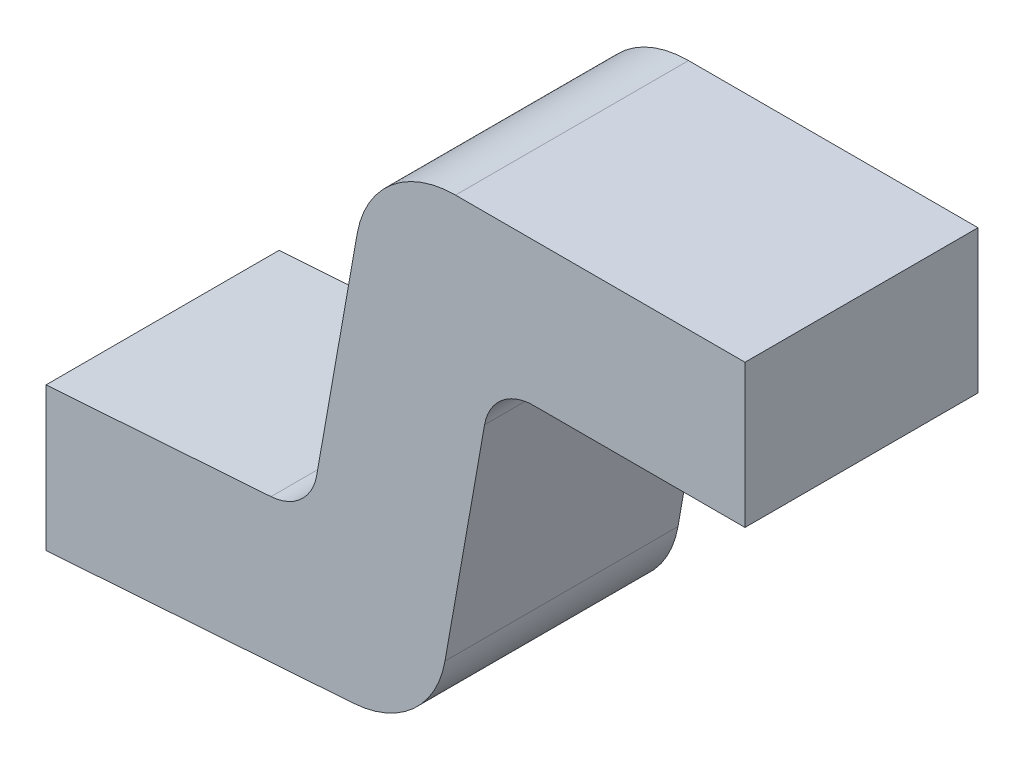
ISO-10303-21;
HEADER;
FILE_DESCRIPTION(('STEP AP214'),'2;1');
FILE_NAME('part.step','',(''),(''),'','','');
FILE_SCHEMA(('AUTOMOTIVE_DESIGN { 1 0 10303 214 1 1 1 1 }'));
ENDSEC;
DATA;
#1=APPLICATION_CONTEXT('core data for automotive mechanical design processes');
#2=APPLICATION_PROTOCOL_DEFINITION('international standard','automotive_design',2000,#1);
#3=PRODUCT_CONTEXT('',#1,'mechanical');
#4=PRODUCT('Part','Part','',(#3));
#5=PRODUCT_RELATED_PRODUCT_CATEGORY('part','',(#4));
#6=PRODUCT_DEFINITION_FORMATION('','',#4);
#7=PRODUCT_DEFINITION_CONTEXT('part definition',#1,'design');
#8=PRODUCT_DEFINITION('design','',#6,#7);
#9=PRODUCT_DEFINITION_SHAPE('','',#8);
#10=(LENGTH_UNIT() NAMED_UNIT(*) SI_UNIT(.MILLI.,.METRE.));
#11=(NAMED_UNIT(*) PLANE_ANGLE_UNIT() SI_UNIT($,.RADIAN.));
#12=(NAMED_UNIT(*) SI_UNIT($,.STERADIAN.) SOLID_ANGLE_UNIT());
#13=UNCERTAINTY_MEASURE_WITH_UNIT(LENGTH_MEASURE(1.E-05),#10,'distance_accuracy_value','');
#14=(GEOMETRIC_REPRESENTATION_CONTEXT(3) GLOBAL_UNCERTAINTY_ASSIGNED_CONTEXT((#13)) GLOBAL_UNIT_ASSIGNED_CONTEXT((#10,
#11,#12)) REPRESENTATION_CONTEXT('',''));
#15=CARTESIAN_POINT('',(0.,0.,0.));
#16=DIRECTION('',(0.,0.,1.));
#17=DIRECTION('',(1.,0.,0.));
#18=AXIS2_PLACEMENT_3D('',#15,#16,#17);
#19=CARTESIAN_POINT('',(0.526665309674,0.392731120359,0.));
#20=DIRECTION('',(0.,0.,1.));
#21=DIRECTION('',(1.,0.,0.));
#22=AXIS2_PLACEMENT_3D('',#19,#20,#21);
#23=PLANE('',#22);
#24=DIRECTION('',(0.,1.,0.));
#25=VECTOR('',#24,1.);
#26=CARTESIAN_POINT('',(0.,0.215525008087,0.));
#27=LINE('',#26,#25);
#28=CARTESIAN_POINT('',(0.,0.215525008087024,0.));
#29=VERTEX_POINT('',#28);
#30=CARTESIAN_POINT('',(0.,0.,0.));
#31=VERTEX_POINT('',#30);
#32=EDGE_CURVE('E159',#29,#31,#27,.F.);
#33=ORIENTED_EDGE('',*,*,#32,.T.);
#34=DIRECTION('',(-0.997564050259825,-0.0697564737441177,0.));
#35=VECTOR('',#34,1.);
#36=CARTESIAN_POINT('',(0.,0.,0.));
#37=LINE('',#36,#35);
#38=CARTESIAN_POINT('',(0.462092631901809,0.0323126645712578,0.));
#39=VERTEX_POINT('',#38);
#40=EDGE_CURVE('E151',#31,#39,#37,.F.);
#41=ORIENTED_EDGE('',*,*,#40,.T.);
#42=CARTESIAN_POINT('',(0.45162916084,0.18194727211,0.));
#43=DIRECTION('',(0.,0.,1.));
#44=DIRECTION('',(1.,0.,0.));
#45=AXIS2_PLACEMENT_3D('',#42,#43,#44);
#46=CIRCLE('',#45,0.15);
#47=CARTESIAN_POINT('',(0.599350323791904,0.155900045459974,0.));
#48=VERTEX_POINT('',#47);
#49=EDGE_CURVE('E195',#48,#39,#46,.F.);
#50=ORIENTED_EDGE('',*,*,#49,.F.);
#51=DIRECTION('',(-0.173648177667033,-0.98480775301219,0.));
#52=VECTOR('',#51,1.);
#53=CARTESIAN_POINT('',(0.579,0.04048762411529,0.));
#54=LINE('',#53,#52);
#55=CARTESIAN_POINT('',(0.658794304639196,0.493023613324987,0.));
#56=VERTEX_POINT('',#55);
#57=EDGE_CURVE('E90',#48,#56,#54,.F.);
#58=ORIENTED_EDGE('',*,*,#57,.T.);
#59=CARTESIAN_POINT('',(0.732654886115,0.48,0.));
#60=DIRECTION('',(0.,0.,1.));
#61=DIRECTION('',(1.,0.,0.));
#62=AXIS2_PLACEMENT_3D('',#59,#60,#61);
#63=CIRCLE('',#62,0.075);
#64=CARTESIAN_POINT('',(0.732654886115,0.555,0.));
#65=VERTEX_POINT('',#64);
#66=EDGE_CURVE('E20',#56,#65,#63,.F.);
#67=ORIENTED_EDGE('',*,*,#66,.T.);
#68=DIRECTION('',(-1.,0.,0.));
#69=VECTOR('',#68,1.);
#70=CARTESIAN_POINT('',(0.669722413777,0.555,0.));
#71=LINE('',#70,#69);
#72=CARTESIAN_POINT('',(1.05,0.555,0.));
#73=VERTEX_POINT('',#72);
#74=EDGE_CURVE('E96',#65,#73,#71,.F.);
#75=ORIENTED_EDGE('',*,*,#74,.T.);
#76=DIRECTION('',(0.,-1.,0.));
#77=VECTOR('',#76,1.);
#78=CARTESIAN_POINT('',(1.05,0.555,0.));
#79=LINE('',#78,#77);
#80=CARTESIAN_POINT('',(1.05,0.77,0.));
#81=VERTEX_POINT('',#80);
#82=EDGE_CURVE('E101',#73,#81,#79,.F.);
#83=ORIENTED_EDGE('',*,*,#82,.T.);
#84=DIRECTION('',(1.,0.,0.));
#85=VECTOR('',#84,1.);
#86=CARTESIAN_POINT('',(1.05,0.77,0.));
#87=LINE('',#86,#85);
#88=CARTESIAN_POINT('',(0.61518093775,0.77,0.));
#89=VERTEX_POINT('',#88);
#90=EDGE_CURVE('E119',#81,#89,#87,.F.);
#91=ORIENTED_EDGE('',*,*,#90,.T.);
#92=CARTESIAN_POINT('',(0.61518093775,0.62,0.));
#93=DIRECTION('',(0.,0.,1.));
#94=DIRECTION('',(1.,0.,0.));
#95=AXIS2_PLACEMENT_3D('',#92,#93,#94);
#96=CIRCLE('',#95,0.15);
#97=CARTESIAN_POINT('',(0.467459774798741,0.64604722665,0.));
#98=VERTEX_POINT('',#97);
#99=EDGE_CURVE('E177',#98,#89,#96,.F.);
#100=ORIENTED_EDGE('',*,*,#99,.F.);
#101=DIRECTION('',(0.173648177667033,0.98480775301219,0.));
#102=VECTOR('',#101,1.);
#103=CARTESIAN_POINT('',(0.489315993074,0.77,0.));
#104=LINE('',#103,#102);
#105=CARTESIAN_POINT('',(0.406610292433879,0.300952663581,0.));
#106=VERTEX_POINT('',#105);
#107=EDGE_CURVE('E172',#98,#106,#104,.F.);
#108=ORIENTED_EDGE('',*,*,#107,.T.);
#109=CARTESIAN_POINT('',(0.332749710958,0.313976276906,0.));
#110=DIRECTION('',(0.,0.,1.));
#111=DIRECTION('',(1.,0.,0.));
#112=AXIS2_PLACEMENT_3D('',#109,#110,#111);
#113=CIRCLE('',#112,0.075);
#114=CARTESIAN_POINT('',(0.337981446488916,0.239158973136095,0.));
#115=VERTEX_POINT('',#114);
#116=EDGE_CURVE('E169',#106,#115,#113,.F.);
#117=ORIENTED_EDGE('',*,*,#116,.T.);
#118=DIRECTION('',(0.997564050259825,0.0697564737441177,0.));
#119=VECTOR('',#118,1.);
#120=CARTESIAN_POINT('',(0.396435130538,0.243246452908,0.));
#121=LINE('',#120,#119);
#122=EDGE_CURVE('E165',#115,#29,#121,.F.);
#123=ORIENTED_EDGE('',*,*,#122,.T.);
#124=EDGE_LOOP('',(#33,#41,#50,#58,#67,#75,#83,#91,#100,#108,#117,#123));
#125=FACE_BOUND('',#124,.T.);
#126=ADVANCED_FACE('F17',(#125),#23,.T.);
#127=CARTESIAN_POINT('',(0.579,0.04048762411529,0.));
#128=DIRECTION('',(-0.98480775301219,0.173648177667033,0.));
#129=DIRECTION('',(-0.173648177667033,-0.98480775301219,0.));
#130=AXIS2_PLACEMENT_3D('',#127,#128,#129);
#131=PLANE('',#130);
#132=ORIENTED_EDGE('',*,*,#57,.F.);
#133=DIRECTION('',(0.,0.,1.));
#134=VECTOR('',#133,1.);
#135=CARTESIAN_POINT('',(0.599350323791843,0.155900045460028,0.));
#136=LINE('',#135,#134);
#137=CARTESIAN_POINT('',(0.599350323791927,0.155900045460044,-0.35));
#138=VERTEX_POINT('',#137);
#139=EDGE_CURVE('E154',#138,#48,#136,.T.);
#140=ORIENTED_EDGE('',*,*,#139,.F.);
#141=DIRECTION('',(0.173648177666078,0.984807753012358,0.));
#142=VECTOR('',#141,1.);
#143=CARTESIAN_POINT('',(0.599350323792,0.15590004546,-0.35));
#144=LINE('',#143,#142);
#145=CARTESIAN_POINT('',(0.658794304639037,0.493023613324978,-0.35));
#146=VERTEX_POINT('',#145);
#147=EDGE_CURVE('E194',#138,#146,#144,.T.);
#148=ORIENTED_EDGE('',*,*,#147,.T.);
#149=DIRECTION('',(0.,0.,1.));
#150=VECTOR('',#149,1.);
#151=CARTESIAN_POINT('',(0.658794304639078,0.493023613324986,0.));
#152=LINE('',#151,#150);
#153=EDGE_CURVE('E148',#146,#56,#152,.T.);
#154=ORIENTED_EDGE('',*,*,#153,.T.);
#155=EDGE_LOOP('',(#132,#140,#148,#154));
#156=FACE_BOUND('',#155,.T.);
#157=ADVANCED_FACE('F255',(#156),#131,.F.);
#158=CARTESIAN_POINT('',(0.732654886115,0.48,0.));
#159=DIRECTION('',(0.,0.,1.));
#160=DIRECTION('',(1.,0.,0.));
#161=AXIS2_PLACEMENT_3D('',#158,#159,#160);
#162=CYLINDRICAL_SURFACE('',#161,0.075);
#163=ORIENTED_EDGE('',*,*,#153,.F.);
#164=CARTESIAN_POINT('',(0.732654886115,0.48,-0.35));
#165=DIRECTION('',(0.,0.,1.));
#166=DIRECTION('',(1.,0.,0.));
#167=AXIS2_PLACEMENT_3D('',#164,#165,#166);
#168=CIRCLE('',#167,0.075);
#169=CARTESIAN_POINT('',(0.732654886115,0.555,-0.35));
#170=VERTEX_POINT('',#169);
#171=EDGE_CURVE('E135',#146,#170,#168,.F.);
#172=ORIENTED_EDGE('',*,*,#171,.T.);
#173=DIRECTION('',(0.,0.,1.));
#174=VECTOR('',#173,1.);
#175=CARTESIAN_POINT('',(0.732654886115,0.555,0.));
#176=LINE('',#175,#174);
#177=EDGE_CURVE('E143',#170,#65,#176,.T.);
#178=ORIENTED_EDGE('',*,*,#177,.T.);
#179=ORIENTED_EDGE('',*,*,#66,.F.);
#180=EDGE_LOOP('',(#163,#172,#178,#179));
#181=FACE_BOUND('',#180,.T.);
#182=ADVANCED_FACE('F258',(#181),#162,.F.);
#183=CARTESIAN_POINT('',(0.669722413777,0.555,0.));
#184=DIRECTION('',(0.,1.,0.));
#185=DIRECTION('',(-1.,0.,0.));
#186=AXIS2_PLACEMENT_3D('',#183,#184,#185);
#187=PLANE('',#186);
#188=DIRECTION('',(1.,0.,0.));
#189=VECTOR('',#188,1.);
#190=CARTESIAN_POINT('',(0.526665309674,0.555,-0.35));
#191=LINE('',#190,#189);
#192=CARTESIAN_POINT('',(1.05,0.555,-0.35));
#193=VERTEX_POINT('',#192);
#194=EDGE_CURVE('E133',#170,#193,#191,.T.);
#195=ORIENTED_EDGE('',*,*,#194,.T.);
#196=DIRECTION('',(0.,0.,1.));
#197=VECTOR('',#196,1.);
#198=CARTESIAN_POINT('',(1.05,0.555,0.));
#199=LINE('',#198,#197);
#200=EDGE_CURVE('E108',#193,#73,#199,.T.);
#201=ORIENTED_EDGE('',*,*,#200,.T.);
#202=ORIENTED_EDGE('',*,*,#74,.F.);
#203=ORIENTED_EDGE('',*,*,#177,.F.);
#204=EDGE_LOOP('',(#195,#201,#202,#203));
#205=FACE_BOUND('',#204,.T.);
#206=ADVANCED_FACE('F259',(#205),#187,.F.);
#207=CARTESIAN_POINT('',(1.05,0.555,0.));
#208=DIRECTION('',(-1.,0.,0.));
#209=DIRECTION('',(0.,-1.,0.));
#210=AXIS2_PLACEMENT_3D('',#207,#208,#209);
#211=PLANE('',#210);
#212=ORIENTED_EDGE('',*,*,#200,.F.);
#213=DIRECTION('',(0.,1.,0.));
#214=VECTOR('',#213,1.);
#215=CARTESIAN_POINT('',(1.05,0.392731120359,-0.35));
#216=LINE('',#215,#214);
#217=CARTESIAN_POINT('',(1.05,0.77,-0.35));
#218=VERTEX_POINT('',#217);
#219=EDGE_CURVE('E126',#193,#218,#216,.T.);
#220=ORIENTED_EDGE('',*,*,#219,.T.);
#221=DIRECTION('',(0.,0.,1.));
#222=VECTOR('',#221,1.);
#223=CARTESIAN_POINT('',(1.05,0.77,0.));
#224=LINE('',#223,#222);
#225=EDGE_CURVE('E114',#218,#81,#224,.T.);
#226=ORIENTED_EDGE('',*,*,#225,.T.);
#227=ORIENTED_EDGE('',*,*,#82,.F.);
#228=EDGE_LOOP('',(#212,#220,#226,#227));
#229=FACE_BOUND('',#228,.T.);
#230=ADVANCED_FACE('F132',(#229),#211,.F.);
#231=CARTESIAN_POINT('',(1.05,0.77,0.));
#232=DIRECTION('',(0.,-1.,0.));
#233=DIRECTION('',(1.,0.,0.));
#234=AXIS2_PLACEMENT_3D('',#231,#232,#233);
#235=PLANE('',#234);
#236=ORIENTED_EDGE('',*,*,#90,.F.);
#237=ORIENTED_EDGE('',*,*,#225,.F.);
#238=DIRECTION('',(1.,0.,0.));
#239=VECTOR('',#238,1.);
#240=CARTESIAN_POINT('',(0.526665309674,0.77,-0.35));
#241=LINE('',#240,#239);
#242=CARTESIAN_POINT('',(0.61518093775,0.77,-0.35));
#243=VERTEX_POINT('',#242);
#244=EDGE_CURVE('E118',#218,#243,#241,.F.);
#245=ORIENTED_EDGE('',*,*,#244,.T.);
#246=DIRECTION('',(0.,0.,1.));
#247=VECTOR('',#246,1.);
#248=CARTESIAN_POINT('',(0.61518093775,0.77,0.));
#249=LINE('',#248,#247);
#250=EDGE_CURVE('E198',#89,#243,#249,.F.);
#251=ORIENTED_EDGE('',*,*,#250,.F.);
#252=EDGE_LOOP('',(#236,#237,#245,#251));
#253=FACE_BOUND('',#252,.T.);
#254=ADVANCED_FACE('F116',(#253),#235,.F.);
#255=CARTESIAN_POINT('',(0.61518093775,0.62,0.));
#256=DIRECTION('',(0.,0.,1.));
#257=DIRECTION('',(1.,0.,0.));
#258=AXIS2_PLACEMENT_3D('',#255,#256,#257);
#259=CYLINDRICAL_SURFACE('',#258,0.15);
#260=ORIENTED_EDGE('',*,*,#99,.T.);
#261=ORIENTED_EDGE('',*,*,#250,.T.);
#262=CARTESIAN_POINT('',(0.61518093775,0.62,-0.35));
#263=DIRECTION('',(0.,0.,1.));
#264=DIRECTION('',(1.,0.,0.));
#265=AXIS2_PLACEMENT_3D('',#262,#263,#264);
#266=CIRCLE('',#265,0.15);
#267=CARTESIAN_POINT('',(0.46745977479887,0.646047226649999,-0.35));
#268=VERTEX_POINT('',#267);
#269=EDGE_CURVE('E130',#243,#268,#266,.T.);
#270=ORIENTED_EDGE('',*,*,#269,.T.);
#271=DIRECTION('',(0.,0.,1.));
#272=VECTOR('',#271,1.);
#273=CARTESIAN_POINT('',(0.467459774798748,0.646047226650044,0.));
#274=LINE('',#273,#272);
#275=EDGE_CURVE('E175',#268,#98,#274,.T.);
#276=ORIENTED_EDGE('',*,*,#275,.T.);
#277=EDGE_LOOP('',(#260,#261,#270,#276));
#278=FACE_BOUND('',#277,.T.);
#279=ADVANCED_FACE('F289',(#278),#259,.T.);
#280=CARTESIAN_POINT('',(0.489315993074,0.77,0.));
#281=DIRECTION('',(0.98480775301219,-0.173648177667033,0.));
#282=DIRECTION('',(0.173648177667033,0.98480775301219,0.));
#283=AXIS2_PLACEMENT_3D('',#280,#281,#282);
#284=PLANE('',#283);
#285=ORIENTED_EDGE('',*,*,#107,.F.);
#286=ORIENTED_EDGE('',*,*,#275,.F.);
#287=DIRECTION('',(-0.173648177667308,-0.984807753012142,0.));
#288=VECTOR('',#287,1.);
#289=CARTESIAN_POINT('',(0.467459774799,0.64604722665,-0.35));
#290=LINE('',#289,#288);
#291=CARTESIAN_POINT('',(0.406610292433955,0.300952663580976,-0.35));
#292=VERTEX_POINT('',#291);
#293=EDGE_CURVE('E190',#268,#292,#290,.T.);
#294=ORIENTED_EDGE('',*,*,#293,.T.);
#295=DIRECTION('',(0.,0.,1.));
#296=VECTOR('',#295,1.);
#297=CARTESIAN_POINT('',(0.406610292433922,0.300952663581014,0.));
#298=LINE('',#297,#296);
#299=EDGE_CURVE('E174',#292,#106,#298,.T.);
#300=ORIENTED_EDGE('',*,*,#299,.T.);
#301=EDGE_LOOP('',(#285,#286,#294,#300));
#302=FACE_BOUND('',#301,.T.);
#303=ADVANCED_FACE('F285',(#302),#284,.F.);
#304=CARTESIAN_POINT('',(0.332749710958,0.313976276906,0.));
#305=DIRECTION('',(0.,0.,1.));
#306=DIRECTION('',(1.,0.,0.));
#307=AXIS2_PLACEMENT_3D('',#304,#305,#306);
#308=CYLINDRICAL_SURFACE('',#307,0.075);
#309=ORIENTED_EDGE('',*,*,#299,.F.);
#310=CARTESIAN_POINT('',(0.332749710958,0.313976276906,-0.35));
#311=DIRECTION('',(0.,0.,1.));
#312=DIRECTION('',(1.,0.,0.));
#313=AXIS2_PLACEMENT_3D('',#310,#311,#312);
#314=CIRCLE('',#313,0.075);
#315=CARTESIAN_POINT('',(0.337981446488916,0.239158973136044,-0.35));
#316=VERTEX_POINT('',#315);
#317=EDGE_CURVE('E186',#292,#316,#314,.F.);
#318=ORIENTED_EDGE('',*,*,#317,.T.);
#319=DIRECTION('',(0.,0.,1.));
#320=VECTOR('',#319,1.);
#321=CARTESIAN_POINT('',(0.337981446488993,0.2391589731361,0.));
#322=LINE('',#321,#320);
#323=EDGE_CURVE('E168',#316,#115,#322,.T.);
#324=ORIENTED_EDGE('',*,*,#323,.T.);
#325=ORIENTED_EDGE('',*,*,#116,.F.);
#326=EDGE_LOOP('',(#309,#318,#324,#325));
#327=FACE_BOUND('',#326,.T.);
#328=ADVANCED_FACE('F282',(#327),#308,.F.);
#329=CARTESIAN_POINT('',(0.396435130538,0.243246452908,0.));
#330=DIRECTION('',(0.0697564737441177,-0.997564050259825,0.));
#331=DIRECTION('',(0.997564050259825,0.0697564737441177,0.));
#332=AXIS2_PLACEMENT_3D('',#329,#330,#331);
#333=PLANE('',#332);
#334=DIRECTION('',(-0.997564050259831,-0.0697564737440315,0.));
#335=VECTOR('',#334,1.);
#336=CARTESIAN_POINT('',(0.337981446489,0.239158973136,-0.35));
#337=LINE('',#336,#335);
#338=CARTESIAN_POINT('',(0.,0.215525008087,-0.35));
#339=VERTEX_POINT('',#338);
#340=EDGE_CURVE('E189',#316,#339,#337,.T.);
#341=ORIENTED_EDGE('',*,*,#340,.T.);
#342=DIRECTION('',(0.,0.,1.));
#343=VECTOR('',#342,1.);
#344=CARTESIAN_POINT('',(0.,0.215525008087,0.));
#345=LINE('',#344,#343);
#346=EDGE_CURVE('E162',#339,#29,#345,.T.);
#347=ORIENTED_EDGE('',*,*,#346,.T.);
#348=ORIENTED_EDGE('',*,*,#122,.F.);
#349=ORIENTED_EDGE('',*,*,#323,.F.);
#350=EDGE_LOOP('',(#341,#347,#348,#349));
#351=FACE_BOUND('',#350,.T.);
#352=ADVANCED_FACE('F250',(#351),#333,.F.);
#353=CARTESIAN_POINT('',(0.,0.215525008087,0.));
#354=DIRECTION('',(1.,0.,0.));
#355=DIRECTION('',(0.,1.,0.));
#356=AXIS2_PLACEMENT_3D('',#353,#354,#355);
#357=PLANE('',#356);
#358=ORIENTED_EDGE('',*,*,#346,.F.);
#359=DIRECTION('',(0.,1.,0.));
#360=VECTOR('',#359,1.);
#361=CARTESIAN_POINT('',(0.,0.392731120359,-0.35));
#362=LINE('',#361,#360);
#363=CARTESIAN_POINT('',(0.,0.,-0.35));
#364=VERTEX_POINT('',#363);
#365=EDGE_CURVE('E214',#339,#364,#362,.F.);
#366=ORIENTED_EDGE('',*,*,#365,.T.);
#367=DIRECTION('',(0.,0.,1.));
#368=VECTOR('',#367,1.);
#369=CARTESIAN_POINT('',(0.,0.,0.));
#370=LINE('',#369,#368);
#371=EDGE_CURVE('E155',#364,#31,#370,.T.);
#372=ORIENTED_EDGE('',*,*,#371,.T.);
#373=ORIENTED_EDGE('',*,*,#32,.F.);
#374=EDGE_LOOP('',(#358,#366,#372,#373));
#375=FACE_BOUND('',#374,.T.);
#376=ADVANCED_FACE('F246',(#375),#357,.F.);
#377=CARTESIAN_POINT('',(0.,0.,0.));
#378=DIRECTION('',(-0.0697564737441177,0.997564050259825,0.));
#379=DIRECTION('',(-0.997564050259825,-0.0697564737441177,0.));
#380=AXIS2_PLACEMENT_3D('',#377,#378,#379);
#381=PLANE('',#380);
#382=ORIENTED_EDGE('',*,*,#40,.F.);
#383=ORIENTED_EDGE('',*,*,#371,.F.);
#384=DIRECTION('',(0.997564050259826,0.0697564737440975,0.));
#385=VECTOR('',#384,1.);
#386=CARTESIAN_POINT('',(0.,0.,-0.35));
#387=LINE('',#386,#385);
#388=CARTESIAN_POINT('',(0.462092631901807,0.032312664571253,-0.35));
#389=VERTEX_POINT('',#388);
#390=EDGE_CURVE('E26',#364,#389,#387,.T.);
#391=ORIENTED_EDGE('',*,*,#390,.T.);
#392=DIRECTION('',(0.,0.,1.));
#393=VECTOR('',#392,1.);
#394=CARTESIAN_POINT('',(0.46209263190203,0.0323126645710551,0.));
#395=LINE('',#394,#393);
#396=EDGE_CURVE('E34',#39,#389,#395,.F.);
#397=ORIENTED_EDGE('',*,*,#396,.F.);
#398=EDGE_LOOP('',(#382,#383,#391,#397));
#399=FACE_BOUND('',#398,.T.);
#400=ADVANCED_FACE('F241',(#399),#381,.F.);
#401=CARTESIAN_POINT('',(0.45162916084,0.18194727211,0.));
#402=DIRECTION('',(0.,0.,1.));
#403=DIRECTION('',(1.,0.,0.));
#404=AXIS2_PLACEMENT_3D('',#401,#402,#403);
#405=CYLINDRICAL_SURFACE('',#404,0.15);
#406=ORIENTED_EDGE('',*,*,#49,.T.);
#407=ORIENTED_EDGE('',*,*,#396,.T.);
#408=CARTESIAN_POINT('',(0.45162916084,0.18194727211,-0.35));
#409=DIRECTION('',(0.,0.,1.));
#410=DIRECTION('',(1.,0.,0.));
#411=AXIS2_PLACEMENT_3D('',#408,#409,#410);
#412=CIRCLE('',#411,0.15);
#413=EDGE_CURVE('E11',#389,#138,#412,.T.);
#414=ORIENTED_EDGE('',*,*,#413,.T.);
#415=ORIENTED_EDGE('',*,*,#139,.T.);
#416=EDGE_LOOP('',(#406,#407,#414,#415));
#417=FACE_BOUND('',#416,.T.);
#418=ADVANCED_FACE('F252',(#417),#405,.T.);
#419=CARTESIAN_POINT('',(0.526665309674,0.392731120359,-0.35));
#420=DIRECTION('',(0.,0.,1.));
#421=DIRECTION('',(1.,0.,0.));
#422=AXIS2_PLACEMENT_3D('',#419,#420,#421);
#423=PLANE('',#422);
#424=ORIENTED_EDGE('',*,*,#390,.F.);
#425=ORIENTED_EDGE('',*,*,#365,.F.);
#426=ORIENTED_EDGE('',*,*,#340,.F.);
#427=ORIENTED_EDGE('',*,*,#317,.F.);
#428=ORIENTED_EDGE('',*,*,#293,.F.);
#429=ORIENTED_EDGE('',*,*,#269,.F.);
#430=ORIENTED_EDGE('',*,*,#244,.F.);
#431=ORIENTED_EDGE('',*,*,#219,.F.);
#432=ORIENTED_EDGE('',*,*,#194,.F.);
#433=ORIENTED_EDGE('',*,*,#171,.F.);
#434=ORIENTED_EDGE('',*,*,#147,.F.);
#435=ORIENTED_EDGE('',*,*,#413,.F.);
#436=EDGE_LOOP('',(#424,#425,#426,#427,#428,#429,#430,#431,#432,#433,#434,#435));
#437=FACE_BOUND('',#436,.T.);
#438=ADVANCED_FACE('F124',(#437),#423,.F.);
#439=CLOSED_SHELL('',(#126,#157,#182,#206,#230,#254,#279,#303,#328,#352,#376,#400,#418,#438));
#440=MANIFOLD_SOLID_BREP('B1',#439);
#441=ADVANCED_BREP_SHAPE_REPRESENTATION('',(#18,#440),#14);
#442=SHAPE_DEFINITION_REPRESENTATION(#9,#441);
ENDSEC;
END-ISO-10303-21;
